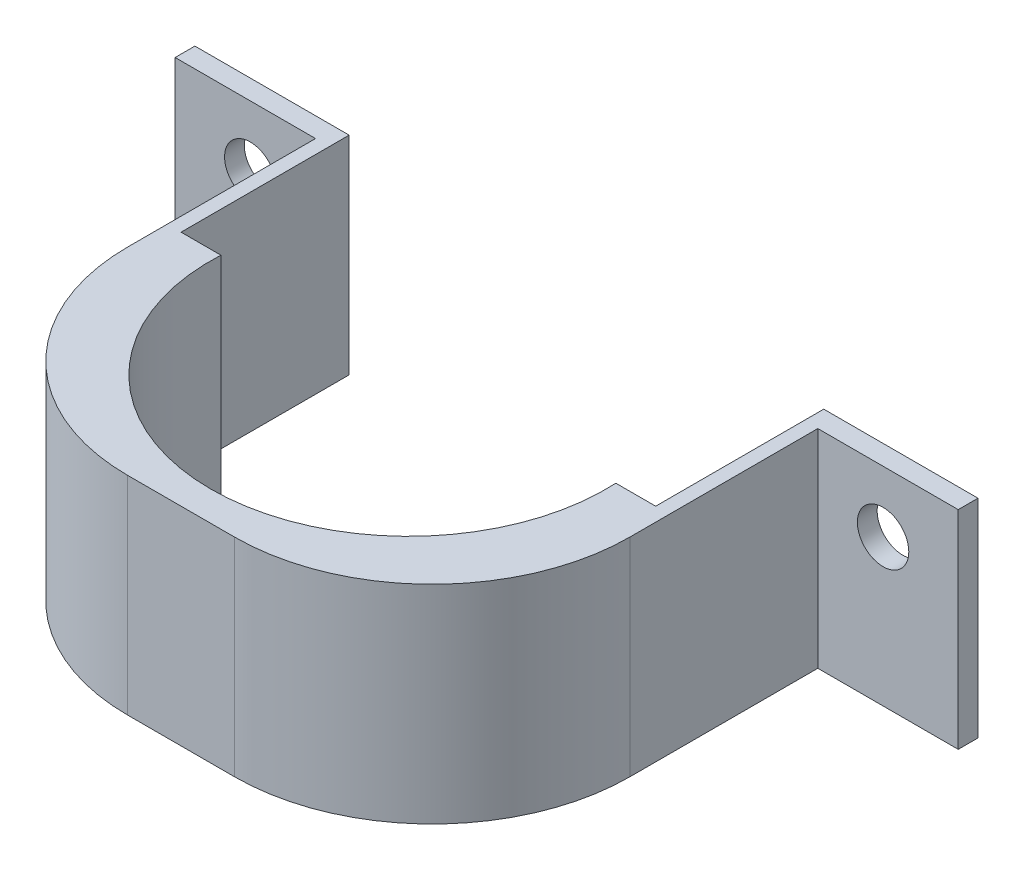
ISO-10303-21;
HEADER;
FILE_DESCRIPTION(('STEP AP214'),'2;1');
FILE_NAME('part.step','',(''),(''),'','','');
FILE_SCHEMA(('AUTOMOTIVE_DESIGN { 1 0 10303 214 1 1 1 1 }'));
ENDSEC;
DATA;
#1=APPLICATION_CONTEXT('core data for automotive mechanical design processes');
#2=APPLICATION_PROTOCOL_DEFINITION('international standard','automotive_design',2000,#1);
#3=PRODUCT_CONTEXT('',#1,'mechanical');
#4=PRODUCT('Part','Part','',(#3));
#5=PRODUCT_RELATED_PRODUCT_CATEGORY('part','',(#4));
#6=PRODUCT_DEFINITION_FORMATION('','',#4);
#7=PRODUCT_DEFINITION_CONTEXT('part definition',#1,'design');
#8=PRODUCT_DEFINITION('design','',#6,#7);
#9=PRODUCT_DEFINITION_SHAPE('','',#8);
#10=(LENGTH_UNIT() NAMED_UNIT(*) SI_UNIT(.MILLI.,.METRE.));
#11=(NAMED_UNIT(*) PLANE_ANGLE_UNIT() SI_UNIT($,.RADIAN.));
#12=(NAMED_UNIT(*) SI_UNIT($,.STERADIAN.) SOLID_ANGLE_UNIT());
#13=UNCERTAINTY_MEASURE_WITH_UNIT(LENGTH_MEASURE(1.E-05),#10,'distance_accuracy_value','');
#14=(GEOMETRIC_REPRESENTATION_CONTEXT(3) GLOBAL_UNCERTAINTY_ASSIGNED_CONTEXT((#13)) GLOBAL_UNIT_ASSIGNED_CONTEXT((#10,
#11,#12)) REPRESENTATION_CONTEXT('',''));
#15=CARTESIAN_POINT('',(0.,0.,0.));
#16=DIRECTION('',(0.,0.,1.));
#17=DIRECTION('',(1.,0.,0.));
#18=AXIS2_PLACEMENT_3D('',#15,#16,#17);
#19=CARTESIAN_POINT('',(0.,0.,0.));
#20=DIRECTION('',(0.,0.,1.));
#21=DIRECTION('',(1.,0.,0.));
#22=AXIS2_PLACEMENT_3D('',#19,#20,#21);
#23=PLANE('',#22);
#24=CARTESIAN_POINT('',(-41.1062178931512,9.05936071860936,0.));
#25=DIRECTION('',(0.,0.,1.));
#26=DIRECTION('',(1.,0.,0.));
#27=AXIS2_PLACEMENT_3D('',#24,#25,#26);
#28=CIRCLE('',#27,3.302);
#29=CARTESIAN_POINT('',(-37.8042178931512,9.05936071860936,0.));
#30=VERTEX_POINT('',#29);
#31=EDGE_CURVE('E327',#30,#30,#28,.T.);
#32=ORIENTED_EDGE('',*,*,#31,.T.);
#33=EDGE_LOOP('',(#32));
#34=FACE_BOUND('',#33,.T.);
#35=DIRECTION('',(0.,-1.,0.));
#36=VECTOR('',#35,1.);
#37=CARTESIAN_POINT('',(-30.9462178931512,16.9344107186094,0.));
#38=LINE('',#37,#36);
#39=CARTESIAN_POINT('',(-30.9462178931512,16.9333607186094,0.));
#40=VERTEX_POINT('',#39);
#41=CARTESIAN_POINT('',(-30.9462178931512,-9.73663928139064,0.));
#42=VERTEX_POINT('',#41);
#43=EDGE_CURVE('E166',#40,#42,#38,.T.);
#44=ORIENTED_EDGE('',*,*,#43,.T.);
#45=DIRECTION('',(1.,0.,0.));
#46=VECTOR('',#45,1.);
#47=CARTESIAN_POINT('',(-50.7582178931512,-9.73663928139064,0.));
#48=LINE('',#47,#46);
#49=CARTESIAN_POINT('',(-50.7582178931512,-9.73663928139064,0.));
#50=VERTEX_POINT('',#49);
#51=EDGE_CURVE('E238',#50,#42,#48,.T.);
#52=ORIENTED_EDGE('',*,*,#51,.F.);
#53=DIRECTION('',(0.,-1.,0.));
#54=VECTOR('',#53,1.);
#55=CARTESIAN_POINT('',(-50.7582178931512,16.9333607186094,0.));
#56=LINE('',#55,#54);
#57=CARTESIAN_POINT('',(-50.7582178931512,16.9333607186094,0.));
#58=VERTEX_POINT('',#57);
#59=EDGE_CURVE('E209',#58,#50,#56,.T.);
#60=ORIENTED_EDGE('',*,*,#59,.F.);
#61=DIRECTION('',(-1.,0.,0.));
#62=VECTOR('',#61,1.);
#63=CARTESIAN_POINT('',(-50.7582178931512,16.9333607186094,0.));
#64=LINE('',#63,#62);
#65=EDGE_CURVE('E174',#40,#58,#64,.T.);
#66=ORIENTED_EDGE('',*,*,#65,.F.);
#67=EDGE_LOOP('',(#44,#52,#60,#66));
#68=FACE_BOUND('',#67,.T.);
#69=ADVANCED_FACE('F33',(#34,#68),#23,.F.);
#70=CARTESIAN_POINT('',(0.,0.,2.54));
#71=DIRECTION('',(0.,0.,1.));
#72=DIRECTION('',(1.,0.,0.));
#73=AXIS2_PLACEMENT_3D('',#70,#71,#72);
#74=PLANE('',#73);
#75=DIRECTION('',(0.,-1.,0.));
#76=VECTOR('',#75,1.);
#77=CARTESIAN_POINT('',(-32.7242178931512,16.9333607186094,2.54));
#78=LINE('',#77,#76);
#79=CARTESIAN_POINT('',(-32.7242178931512,16.9333607186094,2.54));
#80=VERTEX_POINT('',#79);
#81=CARTESIAN_POINT('',(-32.7242178931512,-9.73663928139064,2.54));
#82=VERTEX_POINT('',#81);
#83=EDGE_CURVE('E226',#80,#82,#78,.T.);
#84=ORIENTED_EDGE('',*,*,#83,.F.);
#85=DIRECTION('',(-1.,0.,0.));
#86=VECTOR('',#85,1.);
#87=CARTESIAN_POINT('',(-50.7582178931512,16.9333607186094,2.54));
#88=LINE('',#87,#86);
#89=CARTESIAN_POINT('',(-50.7582178931512,16.9333607186094,2.54));
#90=VERTEX_POINT('',#89);
#91=EDGE_CURVE('E206',#80,#90,#88,.T.);
#92=ORIENTED_EDGE('',*,*,#91,.T.);
#93=DIRECTION('',(0.,-1.,0.));
#94=VECTOR('',#93,1.);
#95=CARTESIAN_POINT('',(-50.7582178931512,16.9333607186094,2.54));
#96=LINE('',#95,#94);
#97=CARTESIAN_POINT('',(-50.7582178931512,-9.73663928139064,2.54));
#98=VERTEX_POINT('',#97);
#99=EDGE_CURVE('E173',#90,#98,#96,.T.);
#100=ORIENTED_EDGE('',*,*,#99,.T.);
#101=DIRECTION('',(1.,0.,0.));
#102=VECTOR('',#101,1.);
#103=CARTESIAN_POINT('',(-50.7582178931512,-9.73663928139064,2.54));
#104=LINE('',#103,#102);
#105=EDGE_CURVE('E195',#98,#82,#104,.T.);
#106=ORIENTED_EDGE('',*,*,#105,.T.);
#107=EDGE_LOOP('',(#84,#92,#100,#106));
#108=FACE_BOUND('',#107,.T.);
#109=CARTESIAN_POINT('',(-41.1062178931512,9.05936071860936,2.54));
#110=DIRECTION('',(0.,0.,1.));
#111=DIRECTION('',(1.,0.,0.));
#112=AXIS2_PLACEMENT_3D('',#109,#110,#111);
#113=CIRCLE('',#112,3.302);
#114=CARTESIAN_POINT('',(-37.8042178931512,9.05936071860936,2.54));
#115=VERTEX_POINT('',#114);
#116=EDGE_CURVE('E325',#115,#115,#113,.T.);
#117=ORIENTED_EDGE('',*,*,#116,.F.);
#118=EDGE_LOOP('',(#117));
#119=FACE_BOUND('',#118,.T.);
#120=ADVANCED_FACE('F221',(#108,#119),#74,.T.);
#121=DIRECTION('',(0.,1.,0.));
#122=VECTOR('',#121,1.);
#123=CARTESIAN_POINT('',(31.7917821068488,16.9333607186094,2.54));
#124=LINE('',#123,#122);
#125=CARTESIAN_POINT('',(31.7917821068488,-9.73663928139064,2.54));
#126=VERTEX_POINT('',#125);
#127=CARTESIAN_POINT('',(31.7917821068488,16.9333607186094,2.54));
#128=VERTEX_POINT('',#127);
#129=EDGE_CURVE('E242',#126,#128,#124,.T.);
#130=ORIENTED_EDGE('',*,*,#129,.F.);
#131=CARTESIAN_POINT('',(49.8257821068488,-9.73663928139064,2.54));
#132=VERTEX_POINT('',#131);
#133=EDGE_CURVE('E177',#126,#132,#104,.T.);
#134=ORIENTED_EDGE('',*,*,#133,.T.);
#135=DIRECTION('',(0.,1.,0.));
#136=VECTOR('',#135,1.);
#137=CARTESIAN_POINT('',(49.8257821068488,16.9333607186094,2.54));
#138=LINE('',#137,#136);
#139=CARTESIAN_POINT('',(49.8257821068488,16.9333607186094,2.54));
#140=VERTEX_POINT('',#139);
#141=EDGE_CURVE('E199',#132,#140,#138,.T.);
#142=ORIENTED_EDGE('',*,*,#141,.T.);
#143=EDGE_CURVE('E186',#140,#128,#88,.T.);
#144=ORIENTED_EDGE('',*,*,#143,.T.);
#145=EDGE_LOOP('',(#130,#134,#142,#144));
#146=FACE_BOUND('',#145,.T.);
#147=CARTESIAN_POINT('',(40.1737821068488,9.05936071860936,2.54));
#148=DIRECTION('',(0.,0.,1.));
#149=DIRECTION('',(1.,0.,0.));
#150=AXIS2_PLACEMENT_3D('',#147,#148,#149);
#151=CIRCLE('',#150,3.302);
#152=CARTESIAN_POINT('',(43.4757821068488,9.05936071860936,2.54));
#153=VERTEX_POINT('',#152);
#154=EDGE_CURVE('E263',#153,#153,#151,.T.);
#155=ORIENTED_EDGE('',*,*,#154,.F.);
#156=EDGE_LOOP('',(#155));
#157=FACE_BOUND('',#156,.T.);
#158=ADVANCED_FACE('F340',(#146,#157),#74,.T.);
#159=CARTESIAN_POINT('',(30.0137821068488,-9.73663928139064,0.));
#160=VERTEX_POINT('',#159);
#161=CARTESIAN_POINT('',(49.8257821068488,-9.73663928139064,0.));
#162=VERTEX_POINT('',#161);
#163=EDGE_CURVE('E165',#160,#162,#48,.T.);
#164=ORIENTED_EDGE('',*,*,#163,.F.);
#165=DIRECTION('',(0.,-1.,0.));
#166=VECTOR('',#165,1.);
#167=CARTESIAN_POINT('',(30.0137821068488,16.9344107186094,0.));
#168=LINE('',#167,#166);
#169=CARTESIAN_POINT('',(30.0137821068488,16.9333607186094,0.));
#170=VERTEX_POINT('',#169);
#171=EDGE_CURVE('E150',#170,#160,#168,.T.);
#172=ORIENTED_EDGE('',*,*,#171,.F.);
#173=CARTESIAN_POINT('',(49.8257821068488,16.9333607186094,0.));
#174=VERTEX_POINT('',#173);
#175=EDGE_CURVE('E164',#174,#170,#64,.T.);
#176=ORIENTED_EDGE('',*,*,#175,.F.);
#177=DIRECTION('',(0.,1.,0.));
#178=VECTOR('',#177,1.);
#179=CARTESIAN_POINT('',(49.8257821068488,16.9333607186094,0.));
#180=LINE('',#179,#178);
#181=EDGE_CURVE('E179',#162,#174,#180,.T.);
#182=ORIENTED_EDGE('',*,*,#181,.F.);
#183=EDGE_LOOP('',(#164,#172,#176,#182));
#184=FACE_BOUND('',#183,.T.);
#185=CARTESIAN_POINT('',(40.1737821068488,9.05936071860936,0.));
#186=DIRECTION('',(0.,0.,1.));
#187=DIRECTION('',(1.,0.,0.));
#188=AXIS2_PLACEMENT_3D('',#185,#186,#187);
#189=CIRCLE('',#188,3.302);
#190=CARTESIAN_POINT('',(43.4757821068488,9.05936071860936,0.));
#191=VERTEX_POINT('',#190);
#192=EDGE_CURVE('E292',#191,#191,#189,.T.);
#193=ORIENTED_EDGE('',*,*,#192,.T.);
#194=EDGE_LOOP('',(#193));
#195=FACE_BOUND('',#194,.T.);
#196=ADVANCED_FACE('F161',(#184,#195),#23,.F.);
#197=CARTESIAN_POINT('',(-50.7582178931512,16.9333607186094,2.54));
#198=DIRECTION('',(1.,0.,0.));
#199=DIRECTION('',(0.,0.,-1.));
#200=AXIS2_PLACEMENT_3D('',#197,#198,#199);
#201=PLANE('',#200);
#202=ORIENTED_EDGE('',*,*,#59,.T.);
#203=DIRECTION('',(0.,0.,-1.));
#204=VECTOR('',#203,1.);
#205=CARTESIAN_POINT('',(-50.7582178931512,-9.73663928139064,2.54));
#206=LINE('',#205,#204);
#207=EDGE_CURVE('E191',#98,#50,#206,.T.);
#208=ORIENTED_EDGE('',*,*,#207,.F.);
#209=ORIENTED_EDGE('',*,*,#99,.F.);
#210=DIRECTION('',(0.,0.,-1.));
#211=VECTOR('',#210,1.);
#212=CARTESIAN_POINT('',(-50.7582178931512,16.9333607186094,2.54));
#213=LINE('',#212,#211);
#214=EDGE_CURVE('E183',#90,#58,#213,.T.);
#215=ORIENTED_EDGE('',*,*,#214,.T.);
#216=EDGE_LOOP('',(#202,#208,#209,#215));
#217=FACE_BOUND('',#216,.T.);
#218=ADVANCED_FACE('F232',(#217),#201,.F.);
#219=CARTESIAN_POINT('',(-50.7582178931512,-9.73663928139064,2.54));
#220=DIRECTION('',(0.,1.,0.));
#221=DIRECTION('',(0.,0.,1.));
#222=AXIS2_PLACEMENT_3D('',#219,#220,#221);
#223=PLANE('',#222);
#224=DIRECTION('',(1.,0.,0.));
#225=VECTOR('',#224,1.);
#226=CARTESIAN_POINT('',(-32.7242178931512,-9.73663928139064,52.07));
#227=LINE('',#226,#225);
#228=CARTESIAN_POINT('',(-7.32421789315119,-9.73663928139064,52.07));
#229=VERTEX_POINT('',#228);
#230=CARTESIAN_POINT('',(6.3917821068488,-9.73663928139064,52.07));
#231=VERTEX_POINT('',#230);
#232=EDGE_CURVE('E245',#229,#231,#227,.T.);
#233=ORIENTED_EDGE('',*,*,#232,.F.);
#234=CARTESIAN_POINT('',(-7.32421789315119,-9.73663928139064,26.67));
#235=DIRECTION('',(0.,1.,0.));
#236=DIRECTION('',(0.,0.,1.));
#237=AXIS2_PLACEMENT_3D('',#234,#235,#236);
#238=CIRCLE('',#237,25.4);
#239=CARTESIAN_POINT('',(-32.7242178931512,-9.73663928139064,26.67));
#240=VERTEX_POINT('',#239);
#241=EDGE_CURVE('E286',#229,#240,#238,.F.);
#242=ORIENTED_EDGE('',*,*,#241,.T.);
#243=DIRECTION('',(0.,0.,-1.));
#244=VECTOR('',#243,1.);
#245=CARTESIAN_POINT('',(-32.7242178931512,-9.73663928139064,52.07));
#246=LINE('',#245,#244);
#247=EDGE_CURVE('E239',#240,#82,#246,.T.);
#248=ORIENTED_EDGE('',*,*,#247,.T.);
#249=ORIENTED_EDGE('',*,*,#105,.F.);
#250=ORIENTED_EDGE('',*,*,#207,.T.);
#251=ORIENTED_EDGE('',*,*,#51,.T.);
#252=DIRECTION('',(0.,0.,1.));
#253=VECTOR('',#252,1.);
#254=CARTESIAN_POINT('',(-30.9462178931512,-9.73663928139064,0.));
#255=LINE('',#254,#253);
#256=CARTESIAN_POINT('',(-30.9462178931512,-9.73663928139064,21.59));
#257=VERTEX_POINT('',#256);
#258=EDGE_CURVE('E310',#42,#257,#255,.T.);
#259=ORIENTED_EDGE('',*,*,#258,.T.);
#260=DIRECTION('',(1.,0.,0.));
#261=VECTOR('',#260,1.);
#262=CARTESIAN_POINT('',(0.,-9.73663928139064,21.59));
#263=LINE('',#262,#261);
#264=CARTESIAN_POINT('',(-25.8344480245577,-9.73663928139064,21.59));
#265=VERTEX_POINT('',#264);
#266=EDGE_CURVE('E312',#257,#265,#263,.T.);
#267=ORIENTED_EDGE('',*,*,#266,.T.);
#268=CARTESIAN_POINT('',(-0.466217893151204,-9.73663928139064,22.86));
#269=DIRECTION('',(0.,-1.,0.));
#270=DIRECTION('',(0.,0.,-1.));
#271=AXIS2_PLACEMENT_3D('',#268,#269,#270);
#272=CIRCLE('',#271,25.4);
#273=CARTESIAN_POINT('',(24.9020122382553,-9.73663928139064,21.59));
#274=VERTEX_POINT('',#273);
#275=EDGE_CURVE('E155',#274,#265,#272,.T.);
#276=ORIENTED_EDGE('',*,*,#275,.F.);
#277=DIRECTION('',(1.,0.,0.));
#278=VECTOR('',#277,1.);
#279=CARTESIAN_POINT('',(0.,-9.73663928139064,21.59));
#280=LINE('',#279,#278);
#281=CARTESIAN_POINT('',(30.0137821068488,-9.73663928139064,21.59));
#282=VERTEX_POINT('',#281);
#283=EDGE_CURVE('E300',#274,#282,#280,.T.);
#284=ORIENTED_EDGE('',*,*,#283,.T.);
#285=DIRECTION('',(0.,0.,1.));
#286=VECTOR('',#285,1.);
#287=CARTESIAN_POINT('',(30.0137821068488,-9.73663928139064,0.));
#288=LINE('',#287,#286);
#289=EDGE_CURVE('E308',#160,#282,#288,.T.);
#290=ORIENTED_EDGE('',*,*,#289,.F.);
#291=ORIENTED_EDGE('',*,*,#163,.T.);
#292=DIRECTION('',(0.,0.,-1.));
#293=VECTOR('',#292,1.);
#294=CARTESIAN_POINT('',(49.8257821068488,-9.73663928139064,2.54));
#295=LINE('',#294,#293);
#296=EDGE_CURVE('E188',#132,#162,#295,.T.);
#297=ORIENTED_EDGE('',*,*,#296,.F.);
#298=ORIENTED_EDGE('',*,*,#133,.F.);
#299=DIRECTION('',(0.,0.,-1.));
#300=VECTOR('',#299,1.);
#301=CARTESIAN_POINT('',(31.7917821068488,-9.73663928139064,52.07));
#302=LINE('',#301,#300);
#303=CARTESIAN_POINT('',(31.7917821068488,-9.73663928139064,26.67));
#304=VERTEX_POINT('',#303);
#305=EDGE_CURVE('E272',#304,#126,#302,.T.);
#306=ORIENTED_EDGE('',*,*,#305,.F.);
#307=CARTESIAN_POINT('',(6.3917821068488,-9.73663928139064,26.67));
#308=DIRECTION('',(0.,1.,0.));
#309=DIRECTION('',(0.,0.,1.));
#310=AXIS2_PLACEMENT_3D('',#307,#308,#309);
#311=CIRCLE('',#310,25.4);
#312=EDGE_CURVE('E287',#304,#231,#311,.F.);
#313=ORIENTED_EDGE('',*,*,#312,.T.);
#314=EDGE_LOOP('',(#233,#242,#248,#249,#250,#251,#259,#267,#276,#284,#290,#291,#297,#298,#306,#313));
#315=FACE_BOUND('',#314,.T.);
#316=ADVANCED_FACE('F236',(#315),#223,.F.);
#317=CARTESIAN_POINT('',(49.8257821068488,16.9333607186094,2.54));
#318=DIRECTION('',(-1.,0.,0.));
#319=DIRECTION('',(0.,0.,1.));
#320=AXIS2_PLACEMENT_3D('',#317,#318,#319);
#321=PLANE('',#320);
#322=ORIENTED_EDGE('',*,*,#181,.T.);
#323=DIRECTION('',(0.,0.,-1.));
#324=VECTOR('',#323,1.);
#325=CARTESIAN_POINT('',(49.8257821068488,16.9333607186094,2.54));
#326=LINE('',#325,#324);
#327=EDGE_CURVE('E172',#140,#174,#326,.T.);
#328=ORIENTED_EDGE('',*,*,#327,.F.);
#329=ORIENTED_EDGE('',*,*,#141,.F.);
#330=ORIENTED_EDGE('',*,*,#296,.T.);
#331=EDGE_LOOP('',(#322,#328,#329,#330));
#332=FACE_BOUND('',#331,.T.);
#333=ADVANCED_FACE('F357',(#332),#321,.F.);
#334=CARTESIAN_POINT('',(-50.7582178931512,16.9333607186094,2.54));
#335=DIRECTION('',(0.,-1.,0.));
#336=DIRECTION('',(0.,0.,-1.));
#337=AXIS2_PLACEMENT_3D('',#334,#335,#336);
#338=PLANE('',#337);
#339=DIRECTION('',(0.,0.,-1.));
#340=VECTOR('',#339,1.);
#341=CARTESIAN_POINT('',(-32.7242178931512,16.9333607186094,52.07));
#342=LINE('',#341,#340);
#343=CARTESIAN_POINT('',(-32.7242178931512,16.9333607186094,26.67));
#344=VERTEX_POINT('',#343);
#345=EDGE_CURVE('E241',#344,#80,#342,.T.);
#346=ORIENTED_EDGE('',*,*,#345,.F.);
#347=CARTESIAN_POINT('',(-7.32421789315118,16.9333607186094,26.67));
#348=DIRECTION('',(0.,-1.,0.));
#349=DIRECTION('',(0.,0.,-1.));
#350=AXIS2_PLACEMENT_3D('',#347,#348,#349);
#351=CIRCLE('',#350,25.4);
#352=CARTESIAN_POINT('',(-7.32421789315118,16.9333607186094,52.07));
#353=VERTEX_POINT('',#352);
#354=EDGE_CURVE('E41',#344,#353,#351,.F.);
#355=ORIENTED_EDGE('',*,*,#354,.T.);
#356=DIRECTION('',(-1.,0.,0.));
#357=VECTOR('',#356,1.);
#358=CARTESIAN_POINT('',(-32.7242178931512,16.9333607186094,52.07));
#359=LINE('',#358,#357);
#360=CARTESIAN_POINT('',(6.3917821068488,16.9333607186094,52.07));
#361=VERTEX_POINT('',#360);
#362=EDGE_CURVE('E259',#361,#353,#359,.T.);
#363=ORIENTED_EDGE('',*,*,#362,.F.);
#364=CARTESIAN_POINT('',(6.3917821068488,16.9333607186094,26.67));
#365=DIRECTION('',(0.,-1.,0.));
#366=DIRECTION('',(0.,0.,-1.));
#367=AXIS2_PLACEMENT_3D('',#364,#365,#366);
#368=CIRCLE('',#367,25.4);
#369=CARTESIAN_POINT('',(31.7917821068488,16.9333607186094,26.67));
#370=VERTEX_POINT('',#369);
#371=EDGE_CURVE('E48',#361,#370,#368,.F.);
#372=ORIENTED_EDGE('',*,*,#371,.T.);
#373=DIRECTION('',(0.,0.,-1.));
#374=VECTOR('',#373,1.);
#375=CARTESIAN_POINT('',(31.7917821068488,16.9333607186094,52.07));
#376=LINE('',#375,#374);
#377=EDGE_CURVE('E269',#370,#128,#376,.T.);
#378=ORIENTED_EDGE('',*,*,#377,.T.);
#379=ORIENTED_EDGE('',*,*,#143,.F.);
#380=ORIENTED_EDGE('',*,*,#327,.T.);
#381=ORIENTED_EDGE('',*,*,#175,.T.);
#382=DIRECTION('',(0.,0.,-1.));
#383=VECTOR('',#382,1.);
#384=CARTESIAN_POINT('',(30.0137821068488,16.9333607186094,0.));
#385=LINE('',#384,#383);
#386=CARTESIAN_POINT('',(30.0137821068488,16.9333607186094,21.59));
#387=VERTEX_POINT('',#386);
#388=EDGE_CURVE('E146',#387,#170,#385,.T.);
#389=ORIENTED_EDGE('',*,*,#388,.F.);
#390=DIRECTION('',(-1.,0.,0.));
#391=VECTOR('',#390,1.);
#392=CARTESIAN_POINT('',(0.,16.9333607186094,21.59));
#393=LINE('',#392,#391);
#394=CARTESIAN_POINT('',(24.9020122382553,16.9333607186094,21.59));
#395=VERTEX_POINT('',#394);
#396=EDGE_CURVE('E156',#387,#395,#393,.T.);
#397=ORIENTED_EDGE('',*,*,#396,.T.);
#398=CARTESIAN_POINT('',(-0.466217893151204,16.9333607186094,22.86));
#399=DIRECTION('',(0.,-1.,0.));
#400=DIRECTION('',(0.,0.,-1.));
#401=AXIS2_PLACEMENT_3D('',#398,#399,#400);
#402=CIRCLE('',#401,25.4);
#403=CARTESIAN_POINT('',(-25.8344480245577,16.9333607186094,21.59));
#404=VERTEX_POINT('',#403);
#405=EDGE_CURVE('E318',#404,#395,#402,.F.);
#406=ORIENTED_EDGE('',*,*,#405,.F.);
#407=DIRECTION('',(-1.,0.,0.));
#408=VECTOR('',#407,1.);
#409=CARTESIAN_POINT('',(0.,16.9333607186094,21.59));
#410=LINE('',#409,#408);
#411=CARTESIAN_POINT('',(-30.9462178931512,16.9333607186094,21.59));
#412=VERTEX_POINT('',#411);
#413=EDGE_CURVE('E243',#404,#412,#410,.T.);
#414=ORIENTED_EDGE('',*,*,#413,.T.);
#415=DIRECTION('',(0.,0.,-1.));
#416=VECTOR('',#415,1.);
#417=CARTESIAN_POINT('',(-30.9462178931512,16.9333607186094,0.));
#418=LINE('',#417,#416);
#419=EDGE_CURVE('E320',#412,#40,#418,.T.);
#420=ORIENTED_EDGE('',*,*,#419,.T.);
#421=ORIENTED_EDGE('',*,*,#65,.T.);
#422=ORIENTED_EDGE('',*,*,#214,.F.);
#423=ORIENTED_EDGE('',*,*,#91,.F.);
#424=EDGE_LOOP('',(#346,#355,#363,#372,#378,#379,#380,#381,#389,#397,#406,#414,#420,#421,#422,#423));
#425=FACE_BOUND('',#424,.T.);
#426=ADVANCED_FACE('F169',(#425),#338,.F.);
#427=CARTESIAN_POINT('',(-41.1062178931512,9.05936071860936,2.54));
#428=DIRECTION('',(0.,0.,-1.));
#429=DIRECTION('',(-1.,0.,0.));
#430=AXIS2_PLACEMENT_3D('',#427,#428,#429);
#431=CYLINDRICAL_SURFACE('',#430,3.302);
#432=ORIENTED_EDGE('',*,*,#116,.T.);
#433=EDGE_LOOP('',(#432));
#434=FACE_BOUND('',#433,.T.);
#435=ORIENTED_EDGE('',*,*,#31,.F.);
#436=EDGE_LOOP('',(#435));
#437=FACE_BOUND('',#436,.T.);
#438=ADVANCED_FACE('F356',(#434,#437),#431,.F.);
#439=CARTESIAN_POINT('',(40.1737821068488,9.05936071860936,2.54));
#440=DIRECTION('',(0.,0.,-1.));
#441=DIRECTION('',(-1.,0.,0.));
#442=AXIS2_PLACEMENT_3D('',#439,#440,#441);
#443=CYLINDRICAL_SURFACE('',#442,3.302);
#444=ORIENTED_EDGE('',*,*,#154,.T.);
#445=EDGE_LOOP('',(#444));
#446=FACE_BOUND('',#445,.T.);
#447=ORIENTED_EDGE('',*,*,#192,.F.);
#448=EDGE_LOOP('',(#447));
#449=FACE_BOUND('',#448,.T.);
#450=ADVANCED_FACE('F337',(#446,#449),#443,.F.);
#451=CARTESIAN_POINT('',(-32.7242178931512,16.9333607186094,52.07));
#452=DIRECTION('',(1.,0.,0.));
#453=DIRECTION('',(0.,1.,0.));
#454=AXIS2_PLACEMENT_3D('',#451,#452,#453);
#455=PLANE('',#454);
#456=ORIENTED_EDGE('',*,*,#247,.F.);
#457=DIRECTION('',(0.,-1.,0.));
#458=VECTOR('',#457,1.);
#459=CARTESIAN_POINT('',(-32.7242178931512,16.9333607186094,26.67));
#460=LINE('',#459,#458);
#461=EDGE_CURVE('E56',#240,#344,#460,.F.);
#462=ORIENTED_EDGE('',*,*,#461,.T.);
#463=ORIENTED_EDGE('',*,*,#345,.T.);
#464=ORIENTED_EDGE('',*,*,#83,.T.);
#465=EDGE_LOOP('',(#456,#462,#463,#464));
#466=FACE_BOUND('',#465,.T.);
#467=ADVANCED_FACE('F240',(#466),#455,.F.);
#468=CARTESIAN_POINT('',(31.7917821068488,16.9333607186094,52.07));
#469=DIRECTION('',(-1.,0.,0.));
#470=DIRECTION('',(0.,0.,1.));
#471=AXIS2_PLACEMENT_3D('',#468,#469,#470);
#472=PLANE('',#471);
#473=ORIENTED_EDGE('',*,*,#377,.F.);
#474=DIRECTION('',(0.,1.,0.));
#475=VECTOR('',#474,1.);
#476=CARTESIAN_POINT('',(31.7917821068488,-9.73663928139064,26.67));
#477=LINE('',#476,#475);
#478=EDGE_CURVE('E11',#370,#304,#477,.F.);
#479=ORIENTED_EDGE('',*,*,#478,.T.);
#480=ORIENTED_EDGE('',*,*,#305,.T.);
#481=ORIENTED_EDGE('',*,*,#129,.T.);
#482=EDGE_LOOP('',(#473,#479,#480,#481));
#483=FACE_BOUND('',#482,.T.);
#484=ADVANCED_FACE('F387',(#483),#472,.F.);
#485=CARTESIAN_POINT('',(0.,0.,52.07));
#486=DIRECTION('',(0.,0.,1.));
#487=DIRECTION('',(1.,0.,0.));
#488=AXIS2_PLACEMENT_3D('',#485,#486,#487);
#489=PLANE('',#488);
#490=ORIENTED_EDGE('',*,*,#362,.T.);
#491=DIRECTION('',(0.,-1.,0.));
#492=VECTOR('',#491,1.);
#493=CARTESIAN_POINT('',(-7.32421789315119,-9.73663928139064,52.07));
#494=LINE('',#493,#492);
#495=EDGE_CURVE('E283',#353,#229,#494,.T.);
#496=ORIENTED_EDGE('',*,*,#495,.T.);
#497=ORIENTED_EDGE('',*,*,#232,.T.);
#498=DIRECTION('',(0.,1.,0.));
#499=VECTOR('',#498,1.);
#500=CARTESIAN_POINT('',(6.3917821068488,16.9333607186094,52.07));
#501=LINE('',#500,#499);
#502=EDGE_CURVE('E194',#231,#361,#501,.T.);
#503=ORIENTED_EDGE('',*,*,#502,.T.);
#504=EDGE_LOOP('',(#490,#496,#497,#503));
#505=FACE_BOUND('',#504,.T.);
#506=ADVANCED_FACE('F281',(#505),#489,.T.);
#507=CARTESIAN_POINT('',(-0.466217893151204,16.9344107186094,22.86));
#508=DIRECTION('',(0.,-1.,0.));
#509=DIRECTION('',(0.,0.,-1.));
#510=AXIS2_PLACEMENT_3D('',#507,#508,#509);
#511=CYLINDRICAL_SURFACE('',#510,25.4);
#512=ORIENTED_EDGE('',*,*,#405,.T.);
#513=DIRECTION('',(0.,-1.,0.));
#514=VECTOR('',#513,1.);
#515=CARTESIAN_POINT('',(24.9020122382553,16.9344107186094,21.59));
#516=LINE('',#515,#514);
#517=EDGE_CURVE('E247',#395,#274,#516,.T.);
#518=ORIENTED_EDGE('',*,*,#517,.T.);
#519=ORIENTED_EDGE('',*,*,#275,.T.);
#520=DIRECTION('',(0.,-1.,0.));
#521=VECTOR('',#520,1.);
#522=CARTESIAN_POINT('',(-25.8344480245577,16.9344107186094,21.59));
#523=LINE('',#522,#521);
#524=EDGE_CURVE('E297',#404,#265,#523,.T.);
#525=ORIENTED_EDGE('',*,*,#524,.F.);
#526=EDGE_LOOP('',(#512,#518,#519,#525));
#527=FACE_BOUND('',#526,.T.);
#528=ADVANCED_FACE('F380',(#527),#511,.F.);
#529=CARTESIAN_POINT('',(0.,16.9344107186094,21.59));
#530=DIRECTION('',(0.,0.,-1.));
#531=DIRECTION('',(-1.,0.,0.));
#532=AXIS2_PLACEMENT_3D('',#529,#530,#531);
#533=PLANE('',#532);
#534=DIRECTION('',(0.,-1.,0.));
#535=VECTOR('',#534,1.);
#536=CARTESIAN_POINT('',(30.0137821068488,16.9344107186094,21.59));
#537=LINE('',#536,#535);
#538=EDGE_CURVE('E152',#387,#282,#537,.T.);
#539=ORIENTED_EDGE('',*,*,#538,.T.);
#540=ORIENTED_EDGE('',*,*,#283,.F.);
#541=ORIENTED_EDGE('',*,*,#517,.F.);
#542=ORIENTED_EDGE('',*,*,#396,.F.);
#543=EDGE_LOOP('',(#539,#540,#541,#542));
#544=FACE_BOUND('',#543,.T.);
#545=ADVANCED_FACE('F383',(#544),#533,.T.);
#546=CARTESIAN_POINT('',(30.0137821068488,16.9344107186094,0.));
#547=DIRECTION('',(1.,0.,0.));
#548=DIRECTION('',(0.,0.,-1.));
#549=AXIS2_PLACEMENT_3D('',#546,#547,#548);
#550=PLANE('',#549);
#551=ORIENTED_EDGE('',*,*,#388,.T.);
#552=ORIENTED_EDGE('',*,*,#171,.T.);
#553=ORIENTED_EDGE('',*,*,#289,.T.);
#554=ORIENTED_EDGE('',*,*,#538,.F.);
#555=EDGE_LOOP('',(#551,#552,#553,#554));
#556=FACE_BOUND('',#555,.T.);
#557=ADVANCED_FACE('F148',(#556),#550,.F.);
#558=CARTESIAN_POINT('',(-30.9462178931512,16.9344107186094,0.));
#559=DIRECTION('',(1.,0.,0.));
#560=DIRECTION('',(0.,0.,-1.));
#561=AXIS2_PLACEMENT_3D('',#558,#559,#560);
#562=PLANE('',#561);
#563=DIRECTION('',(0.,-1.,0.));
#564=VECTOR('',#563,1.);
#565=CARTESIAN_POINT('',(-30.9462178931512,16.9344107186094,21.59));
#566=LINE('',#565,#564);
#567=EDGE_CURVE('E299',#412,#257,#566,.T.);
#568=ORIENTED_EDGE('',*,*,#567,.T.);
#569=ORIENTED_EDGE('',*,*,#258,.F.);
#570=ORIENTED_EDGE('',*,*,#43,.F.);
#571=ORIENTED_EDGE('',*,*,#419,.F.);
#572=EDGE_LOOP('',(#568,#569,#570,#571));
#573=FACE_BOUND('',#572,.T.);
#574=ADVANCED_FACE('F371',(#573),#562,.T.);
#575=CARTESIAN_POINT('',(0.,16.9344107186094,21.59));
#576=DIRECTION('',(0.,0.,-1.));
#577=DIRECTION('',(-1.,0.,0.));
#578=AXIS2_PLACEMENT_3D('',#575,#576,#577);
#579=PLANE('',#578);
#580=ORIENTED_EDGE('',*,*,#524,.T.);
#581=ORIENTED_EDGE('',*,*,#266,.F.);
#582=ORIENTED_EDGE('',*,*,#567,.F.);
#583=ORIENTED_EDGE('',*,*,#413,.F.);
#584=EDGE_LOOP('',(#580,#581,#582,#583));
#585=FACE_BOUND('',#584,.T.);
#586=ADVANCED_FACE('F365',(#585),#579,.T.);
#587=CARTESIAN_POINT('',(-7.32421789315118,0.,26.67));
#588=DIRECTION('',(0.,1.,0.));
#589=DIRECTION('',(-1.,0.,0.));
#590=AXIS2_PLACEMENT_3D('',#587,#588,#589);
#591=CYLINDRICAL_SURFACE('',#590,25.4);
#592=ORIENTED_EDGE('',*,*,#354,.F.);
#593=ORIENTED_EDGE('',*,*,#461,.F.);
#594=ORIENTED_EDGE('',*,*,#241,.F.);
#595=ORIENTED_EDGE('',*,*,#495,.F.);
#596=EDGE_LOOP('',(#592,#593,#594,#595));
#597=FACE_BOUND('',#596,.T.);
#598=ADVANCED_FACE('F285',(#597),#591,.T.);
#599=CARTESIAN_POINT('',(6.3917821068488,0.,26.67));
#600=DIRECTION('',(0.,-1.,0.));
#601=DIRECTION('',(0.,0.,-1.));
#602=AXIS2_PLACEMENT_3D('',#599,#600,#601);
#603=CYLINDRICAL_SURFACE('',#602,25.4);
#604=ORIENTED_EDGE('',*,*,#312,.F.);
#605=ORIENTED_EDGE('',*,*,#478,.F.);
#606=ORIENTED_EDGE('',*,*,#371,.F.);
#607=ORIENTED_EDGE('',*,*,#502,.F.);
#608=EDGE_LOOP('',(#604,#605,#606,#607));
#609=FACE_BOUND('',#608,.T.);
#610=ADVANCED_FACE('F35',(#609),#603,.T.);
#611=CLOSED_SHELL('',(#69,#120,#158,#196,#218,#316,#333,#426,#438,#450,#467,#484,#506,#528,#545,
#557,#574,#586,#598,#610));
#612=MANIFOLD_SOLID_BREP('B2',#611);
#613=ADVANCED_BREP_SHAPE_REPRESENTATION('',(#18,#612),#14);
#614=SHAPE_DEFINITION_REPRESENTATION(#9,#613);
ENDSEC;
END-ISO-10303-21;
